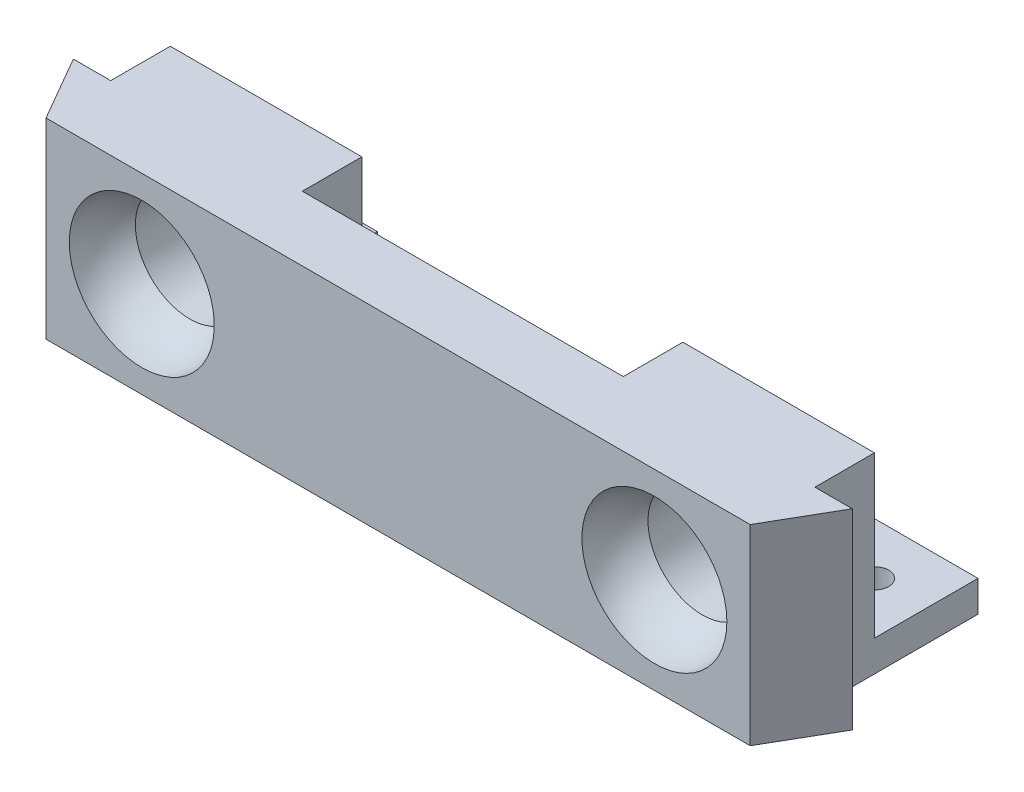
ISO-10303-21;
HEADER;
FILE_DESCRIPTION(('STEP AP214'),'2;1');
FILE_NAME('part.step','',(''),(''),'','','');
FILE_SCHEMA(('AUTOMOTIVE_DESIGN { 1 0 10303 214 1 1 1 1 }'));
ENDSEC;
DATA;
#1=APPLICATION_CONTEXT('core data for automotive mechanical design processes');
#2=APPLICATION_PROTOCOL_DEFINITION('international standard','automotive_design',2000,#1);
#3=PRODUCT_CONTEXT('',#1,'mechanical');
#4=PRODUCT('Part','Part','',(#3));
#5=PRODUCT_RELATED_PRODUCT_CATEGORY('part','',(#4));
#6=PRODUCT_DEFINITION_FORMATION('','',#4);
#7=PRODUCT_DEFINITION_CONTEXT('part definition',#1,'design');
#8=PRODUCT_DEFINITION('design','',#6,#7);
#9=PRODUCT_DEFINITION_SHAPE('','',#8);
#10=(LENGTH_UNIT() NAMED_UNIT(*) SI_UNIT(.MILLI.,.METRE.));
#11=(NAMED_UNIT(*) PLANE_ANGLE_UNIT() SI_UNIT($,.RADIAN.));
#12=(NAMED_UNIT(*) SI_UNIT($,.STERADIAN.) SOLID_ANGLE_UNIT());
#13=UNCERTAINTY_MEASURE_WITH_UNIT(LENGTH_MEASURE(1.E-05),#10,'distance_accuracy_value','');
#14=(GEOMETRIC_REPRESENTATION_CONTEXT(3) GLOBAL_UNCERTAINTY_ASSIGNED_CONTEXT((#13)) GLOBAL_UNIT_ASSIGNED_CONTEXT((#10,
#11,#12)) REPRESENTATION_CONTEXT('',''));
#15=CARTESIAN_POINT('',(0.,0.,0.));
#16=DIRECTION('',(0.,0.,1.));
#17=DIRECTION('',(1.,0.,0.));
#18=AXIS2_PLACEMENT_3D('',#15,#16,#17);
#19=CARTESIAN_POINT('',(34.,18.5,-12.));
#20=DIRECTION('',(0.,0.,1.));
#21=DIRECTION('',(1.,0.,0.));
#22=AXIS2_PLACEMENT_3D('',#19,#20,#21);
#23=PLANE('',#22);
#24=CARTESIAN_POINT('',(24.75,9.25,-12.));
#25=DIRECTION('',(0.,0.,1.));
#26=DIRECTION('',(1.,0.,0.));
#27=AXIS2_PLACEMENT_3D('',#24,#25,#26);
#28=CIRCLE('',#27,5.25);
#29=CARTESIAN_POINT('',(30.,9.25,-12.));
#30=VERTEX_POINT('',#29);
#31=EDGE_CURVE('E216',#30,#30,#28,.T.);
#32=ORIENTED_EDGE('',*,*,#31,.T.);
#33=EDGE_LOOP('',(#32));
#34=FACE_BOUND('',#33,.T.);
#35=DIRECTION('',(0.,-1.,0.));
#36=VECTOR('',#35,1.);
#37=CARTESIAN_POINT('',(24.,3.,-12.));
#38=LINE('',#37,#36);
#39=CARTESIAN_POINT('',(24.,3.,-12.));
#40=VERTEX_POINT('',#39);
#41=CARTESIAN_POINT('',(24.,0.,-12.));
#42=VERTEX_POINT('',#41);
#43=EDGE_CURVE('E181',#40,#42,#38,.T.);
#44=ORIENTED_EDGE('',*,*,#43,.T.);
#45=DIRECTION('',(-1.,0.,0.));
#46=VECTOR('',#45,1.);
#47=CARTESIAN_POINT('',(34.,0.,-12.));
#48=LINE('',#47,#46);
#49=CARTESIAN_POINT('',(15.5,0.,-12.));
#50=VERTEX_POINT('',#49);
#51=EDGE_CURVE('E269',#42,#50,#48,.T.);
#52=ORIENTED_EDGE('',*,*,#51,.T.);
#53=DIRECTION('',(0.,-1.,0.));
#54=VECTOR('',#53,1.);
#55=CARTESIAN_POINT('',(15.5,18.5,-12.));
#56=LINE('',#55,#54);
#57=CARTESIAN_POINT('',(15.5,18.5,-12.));
#58=VERTEX_POINT('',#57);
#59=EDGE_CURVE('E304',#58,#50,#56,.T.);
#60=ORIENTED_EDGE('',*,*,#59,.F.);
#61=DIRECTION('',(-1.,0.,0.));
#62=VECTOR('',#61,1.);
#63=CARTESIAN_POINT('',(34.,18.5,-12.));
#64=LINE('',#63,#62);
#65=CARTESIAN_POINT('',(34.,18.5,-12.));
#66=VERTEX_POINT('',#65);
#67=EDGE_CURVE('E245',#66,#58,#64,.T.);
#68=ORIENTED_EDGE('',*,*,#67,.F.);
#69=DIRECTION('',(0.,-1.,0.));
#70=VECTOR('',#69,1.);
#71=CARTESIAN_POINT('',(34.,18.5,-12.));
#72=LINE('',#71,#70);
#73=CARTESIAN_POINT('',(34.,3.,-12.));
#74=VERTEX_POINT('',#73);
#75=EDGE_CURVE('E53',#66,#74,#72,.T.);
#76=ORIENTED_EDGE('',*,*,#75,.T.);
#77=DIRECTION('',(1.,0.,0.));
#78=VECTOR('',#77,1.);
#79=CARTESIAN_POINT('',(34.,3.,-12.));
#80=LINE('',#79,#78);
#81=EDGE_CURVE('E48',#40,#74,#80,.T.);
#82=ORIENTED_EDGE('',*,*,#81,.F.);
#83=EDGE_LOOP('',(#44,#52,#60,#68,#76,#82));
#84=FACE_BOUND('',#83,.T.);
#85=ADVANCED_FACE('F33',(#34,#84),#23,.F.);
#86=CARTESIAN_POINT('',(-34.,18.5,-12.));
#87=DIRECTION('',(0.,0.,1.));
#88=DIRECTION('',(1.,0.,0.));
#89=AXIS2_PLACEMENT_3D('',#86,#87,#88);
#90=PLANE('',#89);
#91=CARTESIAN_POINT('',(-24.75,9.25,-12.));
#92=DIRECTION('',(0.,0.,-1.));
#93=DIRECTION('',(-1.,0.,0.));
#94=AXIS2_PLACEMENT_3D('',#91,#92,#93);
#95=CIRCLE('',#94,5.25);
#96=CARTESIAN_POINT('',(-30.,9.25,-12.));
#97=VERTEX_POINT('',#96);
#98=EDGE_CURVE('E225',#97,#97,#95,.T.);
#99=ORIENTED_EDGE('',*,*,#98,.F.);
#100=EDGE_LOOP('',(#99));
#101=FACE_BOUND('',#100,.T.);
#102=DIRECTION('',(0.,-1.,0.));
#103=VECTOR('',#102,1.);
#104=CARTESIAN_POINT('',(-24.,3.,-12.));
#105=LINE('',#104,#103);
#106=CARTESIAN_POINT('',(-24.,3.,-12.));
#107=VERTEX_POINT('',#106);
#108=CARTESIAN_POINT('',(-24.,0.,-12.));
#109=VERTEX_POINT('',#108);
#110=EDGE_CURVE('E213',#107,#109,#105,.T.);
#111=ORIENTED_EDGE('',*,*,#110,.F.);
#112=DIRECTION('',(1.,0.,0.));
#113=VECTOR('',#112,1.);
#114=CARTESIAN_POINT('',(-24.,3.,-12.));
#115=LINE('',#114,#113);
#116=CARTESIAN_POINT('',(-34.,3.,-12.));
#117=VERTEX_POINT('',#116);
#118=EDGE_CURVE('E193',#117,#107,#115,.T.);
#119=ORIENTED_EDGE('',*,*,#118,.F.);
#120=DIRECTION('',(0.,-1.,0.));
#121=VECTOR('',#120,1.);
#122=CARTESIAN_POINT('',(-34.,18.5,-12.));
#123=LINE('',#122,#121);
#124=CARTESIAN_POINT('',(-34.,18.5,-12.));
#125=VERTEX_POINT('',#124);
#126=EDGE_CURVE('E292',#125,#117,#123,.T.);
#127=ORIENTED_EDGE('',*,*,#126,.F.);
#128=DIRECTION('',(-1.,0.,0.));
#129=VECTOR('',#128,1.);
#130=CARTESIAN_POINT('',(-34.,18.5,-12.));
#131=LINE('',#130,#129);
#132=CARTESIAN_POINT('',(-15.5,18.5,-12.));
#133=VERTEX_POINT('',#132);
#134=EDGE_CURVE('E253',#133,#125,#131,.T.);
#135=ORIENTED_EDGE('',*,*,#134,.F.);
#136=DIRECTION('',(0.,-1.,0.));
#137=VECTOR('',#136,1.);
#138=CARTESIAN_POINT('',(-15.5,18.5,-12.));
#139=LINE('',#138,#137);
#140=CARTESIAN_POINT('',(-15.5,0.,-12.));
#141=VERTEX_POINT('',#140);
#142=EDGE_CURVE('E295',#133,#141,#139,.T.);
#143=ORIENTED_EDGE('',*,*,#142,.T.);
#144=DIRECTION('',(-1.,0.,0.));
#145=VECTOR('',#144,1.);
#146=CARTESIAN_POINT('',(-34.,0.,-12.));
#147=LINE('',#146,#145);
#148=EDGE_CURVE('E277',#141,#109,#147,.T.);
#149=ORIENTED_EDGE('',*,*,#148,.T.);
#150=EDGE_LOOP('',(#111,#119,#127,#135,#143,#149));
#151=FACE_BOUND('',#150,.T.);
#152=ADVANCED_FACE('F376',(#101,#151),#90,.F.);
#153=CARTESIAN_POINT('',(34.,18.5,0.));
#154=DIRECTION('',(0.,0.,-1.));
#155=DIRECTION('',(-1.,0.,0.));
#156=AXIS2_PLACEMENT_3D('',#153,#154,#155);
#157=PLANE('',#156);
#158=CARTESIAN_POINT('',(24.75,9.25,0.));
#159=DIRECTION('',(0.,0.,1.));
#160=DIRECTION('',(1.,0.,0.));
#161=AXIS2_PLACEMENT_3D('',#158,#159,#160);
#162=CIRCLE('',#161,7.);
#163=CARTESIAN_POINT('',(31.75,9.25,0.));
#164=VERTEX_POINT('',#163);
#165=EDGE_CURVE('E222',#164,#164,#162,.T.);
#166=ORIENTED_EDGE('',*,*,#165,.F.);
#167=EDGE_LOOP('',(#166));
#168=FACE_BOUND('',#167,.T.);
#169=CARTESIAN_POINT('',(-24.75,9.25,0.));
#170=DIRECTION('',(0.,0.,-1.));
#171=DIRECTION('',(-1.,0.,0.));
#172=AXIS2_PLACEMENT_3D('',#169,#170,#171);
#173=CIRCLE('',#172,7.);
#174=CARTESIAN_POINT('',(-31.75,9.25,0.));
#175=VERTEX_POINT('',#174);
#176=EDGE_CURVE('E231',#175,#175,#173,.T.);
#177=ORIENTED_EDGE('',*,*,#176,.T.);
#178=EDGE_LOOP('',(#177));
#179=FACE_BOUND('',#178,.T.);
#180=DIRECTION('',(1.,0.,0.));
#181=VECTOR('',#180,1.);
#182=CARTESIAN_POINT('',(34.,0.,0.));
#183=LINE('',#182,#181);
#184=CARTESIAN_POINT('',(-34.,0.,0.));
#185=VERTEX_POINT('',#184);
#186=CARTESIAN_POINT('',(34.,0.,0.));
#187=VERTEX_POINT('',#186);
#188=EDGE_CURVE('E234',#185,#187,#183,.T.);
#189=ORIENTED_EDGE('',*,*,#188,.T.);
#190=DIRECTION('',(0.,-1.,0.));
#191=VECTOR('',#190,1.);
#192=CARTESIAN_POINT('',(34.,18.5,0.));
#193=LINE('',#192,#191);
#194=CARTESIAN_POINT('',(34.,18.5,0.));
#195=VERTEX_POINT('',#194);
#196=EDGE_CURVE('E11',#195,#187,#193,.T.);
#197=ORIENTED_EDGE('',*,*,#196,.F.);
#198=DIRECTION('',(1.,0.,0.));
#199=VECTOR('',#198,1.);
#200=CARTESIAN_POINT('',(34.,18.5,0.));
#201=LINE('',#200,#199);
#202=CARTESIAN_POINT('',(-34.,18.5,0.));
#203=VERTEX_POINT('',#202);
#204=EDGE_CURVE('E235',#203,#195,#201,.T.);
#205=ORIENTED_EDGE('',*,*,#204,.F.);
#206=DIRECTION('',(0.,-1.,0.));
#207=VECTOR('',#206,1.);
#208=CARTESIAN_POINT('',(-34.,18.5,0.));
#209=LINE('',#208,#207);
#210=EDGE_CURVE('E261',#203,#185,#209,.T.);
#211=ORIENTED_EDGE('',*,*,#210,.T.);
#212=EDGE_LOOP('',(#189,#197,#205,#211));
#213=FACE_BOUND('',#212,.T.);
#214=ADVANCED_FACE('F35',(#168,#179,#213),#157,.F.);
#215=CARTESIAN_POINT('',(37.6084391824352,18.5,-6.24999999999999));
#216=DIRECTION('',(-0.866025403784436,0.,-0.500000000000004));
#217=DIRECTION('',(-0.500000000000005,0.,0.866025403784436));
#218=AXIS2_PLACEMENT_3D('',#215,#216,#217);
#219=PLANE('',#218);
#220=DIRECTION('',(0.500000000000004,0.,-0.866025403784436));
#221=VECTOR('',#220,1.);
#222=CARTESIAN_POINT('',(37.6084391824352,0.,-6.24999999999999));
#223=LINE('',#222,#221);
#224=CARTESIAN_POINT('',(37.6084391824352,0.,-6.24999999999999));
#225=VERTEX_POINT('',#224);
#226=EDGE_CURVE('E264',#187,#225,#223,.T.);
#227=ORIENTED_EDGE('',*,*,#226,.T.);
#228=DIRECTION('',(0.,-1.,0.));
#229=VECTOR('',#228,1.);
#230=CARTESIAN_POINT('',(37.6084391824352,18.5,-6.24999999999999));
#231=LINE('',#230,#229);
#232=CARTESIAN_POINT('',(37.6084391824352,18.5,-6.24999999999999));
#233=VERTEX_POINT('',#232);
#234=EDGE_CURVE('E41',#233,#225,#231,.T.);
#235=ORIENTED_EDGE('',*,*,#234,.F.);
#236=DIRECTION('',(0.500000000000004,0.,-0.866025403784436));
#237=VECTOR('',#236,1.);
#238=CARTESIAN_POINT('',(37.6084391824352,18.5,-6.24999999999999));
#239=LINE('',#238,#237);
#240=EDGE_CURVE('E238',#195,#233,#239,.T.);
#241=ORIENTED_EDGE('',*,*,#240,.F.);
#242=ORIENTED_EDGE('',*,*,#196,.T.);
#243=EDGE_LOOP('',(#227,#235,#241,#242));
#244=FACE_BOUND('',#243,.T.);
#245=ADVANCED_FACE('F348',(#244),#219,.F.);
#246=CARTESIAN_POINT('',(34.,18.5,-6.24999999999999));
#247=DIRECTION('',(0.,0.,1.));
#248=DIRECTION('',(1.,0.,0.));
#249=AXIS2_PLACEMENT_3D('',#246,#247,#248);
#250=PLANE('',#249);
#251=DIRECTION('',(-1.,0.,0.));
#252=VECTOR('',#251,1.);
#253=CARTESIAN_POINT('',(34.,0.,-6.24999999999999));
#254=LINE('',#253,#252);
#255=CARTESIAN_POINT('',(34.,0.,-6.24999999999999));
#256=VERTEX_POINT('',#255);
#257=EDGE_CURVE('E266',#225,#256,#254,.T.);
#258=ORIENTED_EDGE('',*,*,#257,.T.);
#259=DIRECTION('',(0.,-1.,0.));
#260=VECTOR('',#259,1.);
#261=CARTESIAN_POINT('',(34.,18.5,-6.24999999999999));
#262=LINE('',#261,#260);
#263=CARTESIAN_POINT('',(34.,18.5,-6.24999999999999));
#264=VERTEX_POINT('',#263);
#265=EDGE_CURVE('E308',#264,#256,#262,.T.);
#266=ORIENTED_EDGE('',*,*,#265,.F.);
#267=DIRECTION('',(-1.,0.,0.));
#268=VECTOR('',#267,1.);
#269=CARTESIAN_POINT('',(34.,18.5,-6.24999999999999));
#270=LINE('',#269,#268);
#271=EDGE_CURVE('E241',#233,#264,#270,.T.);
#272=ORIENTED_EDGE('',*,*,#271,.F.);
#273=ORIENTED_EDGE('',*,*,#234,.T.);
#274=EDGE_LOOP('',(#258,#266,#272,#273));
#275=FACE_BOUND('',#274,.T.);
#276=ADVANCED_FACE('F314',(#275),#250,.F.);
#277=CARTESIAN_POINT('',(34.,18.5,-6.24999999999999));
#278=DIRECTION('',(-1.,0.,0.));
#279=DIRECTION('',(0.,0.,1.));
#280=AXIS2_PLACEMENT_3D('',#277,#278,#279);
#281=PLANE('',#280);
#282=DIRECTION('',(0.,0.,-1.));
#283=VECTOR('',#282,1.);
#284=CARTESIAN_POINT('',(34.,0.,-6.24999999999999));
#285=LINE('',#284,#283);
#286=CARTESIAN_POINT('',(34.,0.,-22.));
#287=VERTEX_POINT('',#286);
#288=EDGE_CURVE('E170',#256,#287,#285,.T.);
#289=ORIENTED_EDGE('',*,*,#288,.T.);
#290=DIRECTION('',(0.,-1.,0.));
#291=VECTOR('',#290,1.);
#292=CARTESIAN_POINT('',(34.,3.,-22.));
#293=LINE('',#292,#291);
#294=CARTESIAN_POINT('',(34.,3.,-22.));
#295=VERTEX_POINT('',#294);
#296=EDGE_CURVE('E166',#295,#287,#293,.T.);
#297=ORIENTED_EDGE('',*,*,#296,.F.);
#298=DIRECTION('',(0.,0.,-1.));
#299=VECTOR('',#298,1.);
#300=CARTESIAN_POINT('',(34.,3.,-22.));
#301=LINE('',#300,#299);
#302=EDGE_CURVE('E157',#74,#295,#301,.T.);
#303=ORIENTED_EDGE('',*,*,#302,.F.);
#304=ORIENTED_EDGE('',*,*,#75,.F.);
#305=DIRECTION('',(0.,0.,-1.));
#306=VECTOR('',#305,1.);
#307=CARTESIAN_POINT('',(34.,18.5,-6.24999999999999));
#308=LINE('',#307,#306);
#309=EDGE_CURVE('E243',#264,#66,#308,.T.);
#310=ORIENTED_EDGE('',*,*,#309,.F.);
#311=ORIENTED_EDGE('',*,*,#265,.T.);
#312=EDGE_LOOP('',(#289,#297,#303,#304,#310,#311));
#313=FACE_BOUND('',#312,.T.);
#314=ADVANCED_FACE('F167',(#313),#281,.F.);
#315=CARTESIAN_POINT('',(15.5,18.5,-12.));
#316=DIRECTION('',(1.,0.,0.));
#317=DIRECTION('',(0.,0.,-1.));
#318=AXIS2_PLACEMENT_3D('',#315,#316,#317);
#319=PLANE('',#318);
#320=DIRECTION('',(0.,0.,1.));
#321=VECTOR('',#320,1.);
#322=CARTESIAN_POINT('',(15.5,0.,-12.));
#323=LINE('',#322,#321);
#324=CARTESIAN_POINT('',(15.5,0.,-6.24999999999999));
#325=VERTEX_POINT('',#324);
#326=EDGE_CURVE('E271',#50,#325,#323,.T.);
#327=ORIENTED_EDGE('',*,*,#326,.T.);
#328=DIRECTION('',(0.,-1.,0.));
#329=VECTOR('',#328,1.);
#330=CARTESIAN_POINT('',(15.5,18.5,-6.24999999999999));
#331=LINE('',#330,#329);
#332=CARTESIAN_POINT('',(15.5,18.5,-6.24999999999999));
#333=VERTEX_POINT('',#332);
#334=EDGE_CURVE('E301',#333,#325,#331,.T.);
#335=ORIENTED_EDGE('',*,*,#334,.F.);
#336=DIRECTION('',(0.,0.,1.));
#337=VECTOR('',#336,1.);
#338=CARTESIAN_POINT('',(15.5,18.5,-12.));
#339=LINE('',#338,#337);
#340=EDGE_CURVE('E247',#58,#333,#339,.T.);
#341=ORIENTED_EDGE('',*,*,#340,.F.);
#342=ORIENTED_EDGE('',*,*,#59,.T.);
#343=EDGE_LOOP('',(#327,#335,#341,#342));
#344=FACE_BOUND('',#343,.T.);
#345=ADVANCED_FACE('F328',(#344),#319,.F.);
#346=CARTESIAN_POINT('',(-15.5,18.5,-6.24999999999999));
#347=DIRECTION('',(0.,0.,1.));
#348=DIRECTION('',(1.,0.,0.));
#349=AXIS2_PLACEMENT_3D('',#346,#347,#348);
#350=PLANE('',#349);
#351=DIRECTION('',(-1.,0.,0.));
#352=VECTOR('',#351,1.);
#353=CARTESIAN_POINT('',(-15.5,0.,-6.24999999999999));
#354=LINE('',#353,#352);
#355=CARTESIAN_POINT('',(-15.5,0.,-6.24999999999999));
#356=VERTEX_POINT('',#355);
#357=EDGE_CURVE('E273',#325,#356,#354,.T.);
#358=ORIENTED_EDGE('',*,*,#357,.T.);
#359=DIRECTION('',(0.,-1.,0.));
#360=VECTOR('',#359,1.);
#361=CARTESIAN_POINT('',(-15.5,18.5,-6.24999999999999));
#362=LINE('',#361,#360);
#363=CARTESIAN_POINT('',(-15.5,18.5,-6.24999999999999));
#364=VERTEX_POINT('',#363);
#365=EDGE_CURVE('E298',#364,#356,#362,.T.);
#366=ORIENTED_EDGE('',*,*,#365,.F.);
#367=DIRECTION('',(-1.,0.,0.));
#368=VECTOR('',#367,1.);
#369=CARTESIAN_POINT('',(-15.5,18.5,-6.24999999999999));
#370=LINE('',#369,#368);
#371=EDGE_CURVE('E249',#333,#364,#370,.T.);
#372=ORIENTED_EDGE('',*,*,#371,.F.);
#373=ORIENTED_EDGE('',*,*,#334,.T.);
#374=EDGE_LOOP('',(#358,#366,#372,#373));
#375=FACE_BOUND('',#374,.T.);
#376=ADVANCED_FACE('F335',(#375),#350,.F.);
#377=CARTESIAN_POINT('',(-15.5,18.5,-12.));
#378=DIRECTION('',(-1.,0.,0.));
#379=DIRECTION('',(0.,0.,1.));
#380=AXIS2_PLACEMENT_3D('',#377,#378,#379);
#381=PLANE('',#380);
#382=DIRECTION('',(0.,0.,-1.));
#383=VECTOR('',#382,1.);
#384=CARTESIAN_POINT('',(-15.5,0.,-12.));
#385=LINE('',#384,#383);
#386=EDGE_CURVE('E275',#356,#141,#385,.T.);
#387=ORIENTED_EDGE('',*,*,#386,.T.);
#388=ORIENTED_EDGE('',*,*,#142,.F.);
#389=DIRECTION('',(0.,0.,-1.));
#390=VECTOR('',#389,1.);
#391=CARTESIAN_POINT('',(-15.5,18.5,-12.));
#392=LINE('',#391,#390);
#393=EDGE_CURVE('E251',#364,#133,#392,.T.);
#394=ORIENTED_EDGE('',*,*,#393,.F.);
#395=ORIENTED_EDGE('',*,*,#365,.T.);
#396=EDGE_LOOP('',(#387,#388,#394,#395));
#397=FACE_BOUND('',#396,.T.);
#398=ADVANCED_FACE('F339',(#397),#381,.F.);
#399=CARTESIAN_POINT('',(-34.,18.5,-6.24999999999999));
#400=DIRECTION('',(1.,0.,0.));
#401=DIRECTION('',(0.,0.,-1.));
#402=AXIS2_PLACEMENT_3D('',#399,#400,#401);
#403=PLANE('',#402);
#404=DIRECTION('',(0.,0.,1.));
#405=VECTOR('',#404,1.);
#406=CARTESIAN_POINT('',(-34.,0.,-6.24999999999999));
#407=LINE('',#406,#405);
#408=CARTESIAN_POINT('',(-34.,0.,-22.));
#409=VERTEX_POINT('',#408);
#410=CARTESIAN_POINT('',(-34.,0.,-6.24999999999999));
#411=VERTEX_POINT('',#410);
#412=EDGE_CURVE('E279',#409,#411,#407,.T.);
#413=ORIENTED_EDGE('',*,*,#412,.T.);
#414=DIRECTION('',(0.,-1.,0.));
#415=VECTOR('',#414,1.);
#416=CARTESIAN_POINT('',(-34.,18.5,-6.24999999999999));
#417=LINE('',#416,#415);
#418=CARTESIAN_POINT('',(-34.,18.5,-6.24999999999999));
#419=VERTEX_POINT('',#418);
#420=EDGE_CURVE('E289',#419,#411,#417,.T.);
#421=ORIENTED_EDGE('',*,*,#420,.F.);
#422=DIRECTION('',(0.,0.,1.));
#423=VECTOR('',#422,1.);
#424=CARTESIAN_POINT('',(-34.,18.5,-6.24999999999999));
#425=LINE('',#424,#423);
#426=EDGE_CURVE('E255',#125,#419,#425,.T.);
#427=ORIENTED_EDGE('',*,*,#426,.F.);
#428=ORIENTED_EDGE('',*,*,#126,.T.);
#429=DIRECTION('',(0.,0.,1.));
#430=VECTOR('',#429,1.);
#431=CARTESIAN_POINT('',(-34.,3.,-12.));
#432=LINE('',#431,#430);
#433=CARTESIAN_POINT('',(-34.,3.,-22.));
#434=VERTEX_POINT('',#433);
#435=EDGE_CURVE('E201',#434,#117,#432,.T.);
#436=ORIENTED_EDGE('',*,*,#435,.F.);
#437=DIRECTION('',(0.,-1.,0.));
#438=VECTOR('',#437,1.);
#439=CARTESIAN_POINT('',(-34.,3.,-22.));
#440=LINE('',#439,#438);
#441=EDGE_CURVE('E204',#434,#409,#440,.T.);
#442=ORIENTED_EDGE('',*,*,#441,.T.);
#443=EDGE_LOOP('',(#413,#421,#427,#428,#436,#442));
#444=FACE_BOUND('',#443,.T.);
#445=ADVANCED_FACE('F363',(#444),#403,.F.);
#446=CARTESIAN_POINT('',(-37.6084391824352,18.5,-6.24999999999999));
#447=DIRECTION('',(0.,0.,1.));
#448=DIRECTION('',(1.,0.,0.));
#449=AXIS2_PLACEMENT_3D('',#446,#447,#448);
#450=PLANE('',#449);
#451=DIRECTION('',(-1.,0.,0.));
#452=VECTOR('',#451,1.);
#453=CARTESIAN_POINT('',(-37.6084391824352,0.,-6.24999999999999));
#454=LINE('',#453,#452);
#455=CARTESIAN_POINT('',(-37.6084391824352,0.,-6.24999999999999));
#456=VERTEX_POINT('',#455);
#457=EDGE_CURVE('E281',#411,#456,#454,.T.);
#458=ORIENTED_EDGE('',*,*,#457,.T.);
#459=DIRECTION('',(0.,-1.,0.));
#460=VECTOR('',#459,1.);
#461=CARTESIAN_POINT('',(-37.6084391824352,18.5,-6.24999999999999));
#462=LINE('',#461,#460);
#463=CARTESIAN_POINT('',(-37.6084391824352,18.5,-6.24999999999999));
#464=VERTEX_POINT('',#463);
#465=EDGE_CURVE('E286',#464,#456,#462,.T.);
#466=ORIENTED_EDGE('',*,*,#465,.F.);
#467=DIRECTION('',(-1.,0.,0.));
#468=VECTOR('',#467,1.);
#469=CARTESIAN_POINT('',(-37.6084391824352,18.5,-6.24999999999999));
#470=LINE('',#469,#468);
#471=EDGE_CURVE('E257',#419,#464,#470,.T.);
#472=ORIENTED_EDGE('',*,*,#471,.F.);
#473=ORIENTED_EDGE('',*,*,#420,.T.);
#474=EDGE_LOOP('',(#458,#466,#472,#473));
#475=FACE_BOUND('',#474,.T.);
#476=ADVANCED_FACE('F359',(#475),#450,.F.);
#477=CARTESIAN_POINT('',(-34.,18.5,0.));
#478=DIRECTION('',(0.866025403784436,0.,-0.500000000000005));
#479=DIRECTION('',(-0.500000000000005,0.,-0.866025403784436));
#480=AXIS2_PLACEMENT_3D('',#477,#478,#479);
#481=PLANE('',#480);
#482=DIRECTION('',(0.500000000000005,0.,0.866025403784436));
#483=VECTOR('',#482,1.);
#484=CARTESIAN_POINT('',(-34.,0.,0.));
#485=LINE('',#484,#483);
#486=EDGE_CURVE('E239',#456,#185,#485,.T.);
#487=ORIENTED_EDGE('',*,*,#486,.T.);
#488=ORIENTED_EDGE('',*,*,#210,.F.);
#489=DIRECTION('',(0.500000000000005,0.,0.866025403784436));
#490=VECTOR('',#489,1.);
#491=CARTESIAN_POINT('',(-34.,18.5,0.));
#492=LINE('',#491,#490);
#493=EDGE_CURVE('E259',#464,#203,#492,.T.);
#494=ORIENTED_EDGE('',*,*,#493,.F.);
#495=ORIENTED_EDGE('',*,*,#465,.T.);
#496=EDGE_LOOP('',(#487,#488,#494,#495));
#497=FACE_BOUND('',#496,.T.);
#498=ADVANCED_FACE('F354',(#497),#481,.F.);
#499=CARTESIAN_POINT('',(0.,18.5,0.));
#500=DIRECTION('',(0.,-1.,0.));
#501=DIRECTION('',(0.,0.,-1.));
#502=AXIS2_PLACEMENT_3D('',#499,#500,#501);
#503=PLANE('',#502);
#504=ORIENTED_EDGE('',*,*,#204,.T.);
#505=ORIENTED_EDGE('',*,*,#240,.T.);
#506=ORIENTED_EDGE('',*,*,#271,.T.);
#507=ORIENTED_EDGE('',*,*,#309,.T.);
#508=ORIENTED_EDGE('',*,*,#67,.T.);
#509=ORIENTED_EDGE('',*,*,#340,.T.);
#510=ORIENTED_EDGE('',*,*,#371,.T.);
#511=ORIENTED_EDGE('',*,*,#393,.T.);
#512=ORIENTED_EDGE('',*,*,#134,.T.);
#513=ORIENTED_EDGE('',*,*,#426,.T.);
#514=ORIENTED_EDGE('',*,*,#471,.T.);
#515=ORIENTED_EDGE('',*,*,#493,.T.);
#516=EDGE_LOOP('',(#504,#505,#506,#507,#508,#509,#510,#511,#512,#513,#514,#515));
#517=FACE_BOUND('',#516,.T.);
#518=ADVANCED_FACE('F343',(#517),#503,.F.);
#519=CARTESIAN_POINT('',(0.,0.,0.));
#520=DIRECTION('',(0.,-1.,0.));
#521=DIRECTION('',(0.,0.,-1.));
#522=AXIS2_PLACEMENT_3D('',#519,#520,#521);
#523=PLANE('',#522);
#524=CARTESIAN_POINT('',(29.,0.,-17.));
#525=DIRECTION('',(0.,-1.,0.));
#526=DIRECTION('',(0.,0.,1.));
#527=AXIS2_PLACEMENT_3D('',#524,#525,#526);
#528=CIRCLE('',#527,1.375);
#529=CARTESIAN_POINT('',(29.,0.,-15.625));
#530=VERTEX_POINT('',#529);
#531=EDGE_CURVE('E570',#530,#530,#528,.T.);
#532=ORIENTED_EDGE('',*,*,#531,.F.);
#533=EDGE_LOOP('',(#532));
#534=FACE_BOUND('',#533,.T.);
#535=CARTESIAN_POINT('',(-29.,0.,-17.));
#536=DIRECTION('',(0.,1.,0.));
#537=DIRECTION('',(0.,0.,1.));
#538=AXIS2_PLACEMENT_3D('',#535,#536,#537);
#539=CIRCLE('',#538,1.375);
#540=CARTESIAN_POINT('',(-29.,0.,-15.625));
#541=VERTEX_POINT('',#540);
#542=EDGE_CURVE('E188',#541,#541,#539,.T.);
#543=ORIENTED_EDGE('',*,*,#542,.T.);
#544=EDGE_LOOP('',(#543));
#545=FACE_BOUND('',#544,.T.);
#546=ORIENTED_EDGE('',*,*,#188,.F.);
#547=ORIENTED_EDGE('',*,*,#486,.F.);
#548=ORIENTED_EDGE('',*,*,#457,.F.);
#549=ORIENTED_EDGE('',*,*,#412,.F.);
#550=DIRECTION('',(-1.,0.,0.));
#551=VECTOR('',#550,1.);
#552=CARTESIAN_POINT('',(-34.,0.,-22.));
#553=LINE('',#552,#551);
#554=CARTESIAN_POINT('',(-24.,0.,-22.));
#555=VERTEX_POINT('',#554);
#556=EDGE_CURVE('E197',#555,#409,#553,.T.);
#557=ORIENTED_EDGE('',*,*,#556,.F.);
#558=DIRECTION('',(0.,0.,-1.));
#559=VECTOR('',#558,1.);
#560=CARTESIAN_POINT('',(-24.,0.,-22.));
#561=LINE('',#560,#559);
#562=EDGE_CURVE('E173',#109,#555,#561,.T.);
#563=ORIENTED_EDGE('',*,*,#562,.F.);
#564=ORIENTED_EDGE('',*,*,#148,.F.);
#565=ORIENTED_EDGE('',*,*,#386,.F.);
#566=ORIENTED_EDGE('',*,*,#357,.F.);
#567=ORIENTED_EDGE('',*,*,#326,.F.);
#568=ORIENTED_EDGE('',*,*,#51,.F.);
#569=DIRECTION('',(0.,0.,1.));
#570=VECTOR('',#569,1.);
#571=CARTESIAN_POINT('',(24.,0.,-12.));
#572=LINE('',#571,#570);
#573=CARTESIAN_POINT('',(24.,0.,-22.));
#574=VERTEX_POINT('',#573);
#575=EDGE_CURVE('E187',#574,#42,#572,.T.);
#576=ORIENTED_EDGE('',*,*,#575,.F.);
#577=DIRECTION('',(-1.,0.,0.));
#578=VECTOR('',#577,1.);
#579=CARTESIAN_POINT('',(24.,0.,-22.));
#580=LINE('',#579,#578);
#581=EDGE_CURVE('E185',#287,#574,#580,.T.);
#582=ORIENTED_EDGE('',*,*,#581,.F.);
#583=ORIENTED_EDGE('',*,*,#288,.F.);
#584=ORIENTED_EDGE('',*,*,#257,.F.);
#585=ORIENTED_EDGE('',*,*,#226,.F.);
#586=EDGE_LOOP('',(#546,#547,#548,#549,#557,#563,#564,#565,#566,#567,#568,#576,#582,#583,#584,#585));
#587=FACE_BOUND('',#586,.T.);
#588=ADVANCED_FACE('F319',(#534,#545,#587),#523,.T.);
#589=CARTESIAN_POINT('',(-24.75,9.25,0.));
#590=DIRECTION('',(0.,0.,-1.));
#591=DIRECTION('',(-1.,0.,0.));
#592=AXIS2_PLACEMENT_3D('',#589,#590,#591);
#593=SPHERICAL_SURFACE('',#592,7.);
#594=ORIENTED_EDGE('',*,*,#176,.F.);
#595=EDGE_LOOP('',(#594));
#596=FACE_BOUND('',#595,.T.);
#597=CARTESIAN_POINT('',(-24.75,9.25,-4.63006479436301));
#598=DIRECTION('',(0.,0.,-1.));
#599=DIRECTION('',(-1.,0.,0.));
#600=AXIS2_PLACEMENT_3D('',#597,#598,#599);
#601=CIRCLE('',#600,5.25000000000001);
#602=CARTESIAN_POINT('',(-30.,9.25,-4.63006479436301));
#603=VERTEX_POINT('',#602);
#604=EDGE_CURVE('E228',#603,#603,#601,.T.);
#605=ORIENTED_EDGE('',*,*,#604,.T.);
#606=EDGE_LOOP('',(#605));
#607=FACE_BOUND('',#606,.T.);
#608=ADVANCED_FACE('F415',(#596,#607),#593,.F.);
#609=CARTESIAN_POINT('',(-24.75,9.25,-35.7158207754107));
#610=DIRECTION('',(0.,0.,-1.));
#611=DIRECTION('',(-1.,0.,0.));
#612=AXIS2_PLACEMENT_3D('',#609,#610,#611);
#613=CYLINDRICAL_SURFACE('',#612,5.25000000000001);
#614=ORIENTED_EDGE('',*,*,#604,.F.);
#615=EDGE_LOOP('',(#614));
#616=FACE_BOUND('',#615,.T.);
#617=ORIENTED_EDGE('',*,*,#98,.T.);
#618=EDGE_LOOP('',(#617));
#619=FACE_BOUND('',#618,.T.);
#620=ADVANCED_FACE('F418',(#616,#619),#613,.F.);
#621=CARTESIAN_POINT('',(24.75,9.25,0.));
#622=DIRECTION('',(0.,0.,-1.));
#623=DIRECTION('',(1.,0.,0.));
#624=AXIS2_PLACEMENT_3D('',#621,#622,#623);
#625=SPHERICAL_SURFACE('',#624,7.);
#626=ORIENTED_EDGE('',*,*,#165,.T.);
#627=EDGE_LOOP('',(#626));
#628=FACE_BOUND('',#627,.T.);
#629=CARTESIAN_POINT('',(24.75,9.25,-4.63006479436301));
#630=DIRECTION('',(0.,0.,1.));
#631=DIRECTION('',(1.,0.,0.));
#632=AXIS2_PLACEMENT_3D('',#629,#630,#631);
#633=CIRCLE('',#632,5.25000000000001);
#634=CARTESIAN_POINT('',(30.,9.25,-4.63006479436301));
#635=VERTEX_POINT('',#634);
#636=EDGE_CURVE('E219',#635,#635,#633,.T.);
#637=ORIENTED_EDGE('',*,*,#636,.F.);
#638=EDGE_LOOP('',(#637));
#639=FACE_BOUND('',#638,.T.);
#640=ADVANCED_FACE('F424',(#628,#639),#625,.F.);
#641=CARTESIAN_POINT('',(24.75,9.25,-35.7158207754107));
#642=DIRECTION('',(0.,0.,-1.));
#643=DIRECTION('',(1.,0.,0.));
#644=AXIS2_PLACEMENT_3D('',#641,#642,#643);
#645=CYLINDRICAL_SURFACE('',#644,5.25000000000001);
#646=ORIENTED_EDGE('',*,*,#636,.T.);
#647=EDGE_LOOP('',(#646));
#648=FACE_BOUND('',#647,.T.);
#649=ORIENTED_EDGE('',*,*,#31,.F.);
#650=EDGE_LOOP('',(#649));
#651=FACE_BOUND('',#650,.T.);
#652=ADVANCED_FACE('F430',(#648,#651),#645,.F.);
#653=CARTESIAN_POINT('',(-24.,3.,-22.));
#654=DIRECTION('',(-1.,0.,0.));
#655=DIRECTION('',(0.,0.,1.));
#656=AXIS2_PLACEMENT_3D('',#653,#654,#655);
#657=PLANE('',#656);
#658=ORIENTED_EDGE('',*,*,#562,.T.);
#659=DIRECTION('',(0.,-1.,0.));
#660=VECTOR('',#659,1.);
#661=CARTESIAN_POINT('',(-24.,3.,-22.));
#662=LINE('',#661,#660);
#663=CARTESIAN_POINT('',(-24.,3.,-22.));
#664=VERTEX_POINT('',#663);
#665=EDGE_CURVE('E210',#664,#555,#662,.T.);
#666=ORIENTED_EDGE('',*,*,#665,.F.);
#667=DIRECTION('',(0.,0.,-1.));
#668=VECTOR('',#667,1.);
#669=CARTESIAN_POINT('',(-24.,3.,-22.));
#670=LINE('',#669,#668);
#671=EDGE_CURVE('E196',#107,#664,#670,.T.);
#672=ORIENTED_EDGE('',*,*,#671,.F.);
#673=ORIENTED_EDGE('',*,*,#110,.T.);
#674=EDGE_LOOP('',(#658,#666,#672,#673));
#675=FACE_BOUND('',#674,.T.);
#676=ADVANCED_FACE('F374',(#675),#657,.F.);
#677=CARTESIAN_POINT('',(-34.,3.,-22.));
#678=DIRECTION('',(0.,0.,1.));
#679=DIRECTION('',(1.,0.,0.));
#680=AXIS2_PLACEMENT_3D('',#677,#678,#679);
#681=PLANE('',#680);
#682=ORIENTED_EDGE('',*,*,#556,.T.);
#683=ORIENTED_EDGE('',*,*,#441,.F.);
#684=DIRECTION('',(-1.,0.,0.));
#685=VECTOR('',#684,1.);
#686=CARTESIAN_POINT('',(-34.,3.,-22.));
#687=LINE('',#686,#685);
#688=EDGE_CURVE('E199',#664,#434,#687,.T.);
#689=ORIENTED_EDGE('',*,*,#688,.F.);
#690=ORIENTED_EDGE('',*,*,#665,.T.);
#691=EDGE_LOOP('',(#682,#683,#689,#690));
#692=FACE_BOUND('',#691,.T.);
#693=ADVANCED_FACE('F369',(#692),#681,.F.);
#694=CARTESIAN_POINT('',(0.,3.,0.));
#695=DIRECTION('',(0.,-1.,0.));
#696=DIRECTION('',(0.,0.,-1.));
#697=AXIS2_PLACEMENT_3D('',#694,#695,#696);
#698=PLANE('',#697);
#699=CARTESIAN_POINT('',(-29.,3.,-17.));
#700=DIRECTION('',(0.,1.,0.));
#701=DIRECTION('',(0.,0.,1.));
#702=AXIS2_PLACEMENT_3D('',#699,#700,#701);
#703=CIRCLE('',#702,1.375);
#704=CARTESIAN_POINT('',(-29.,3.,-15.625));
#705=VERTEX_POINT('',#704);
#706=EDGE_CURVE('E573',#705,#705,#703,.T.);
#707=ORIENTED_EDGE('',*,*,#706,.F.);
#708=EDGE_LOOP('',(#707));
#709=FACE_BOUND('',#708,.T.);
#710=ORIENTED_EDGE('',*,*,#118,.T.);
#711=ORIENTED_EDGE('',*,*,#671,.T.);
#712=ORIENTED_EDGE('',*,*,#688,.T.);
#713=ORIENTED_EDGE('',*,*,#435,.T.);
#714=EDGE_LOOP('',(#710,#711,#712,#713));
#715=FACE_BOUND('',#714,.T.);
#716=ADVANCED_FACE('F378',(#709,#715),#698,.F.);
#717=CARTESIAN_POINT('',(24.,3.,-22.));
#718=DIRECTION('',(0.,0.,1.));
#719=DIRECTION('',(1.,0.,0.));
#720=AXIS2_PLACEMENT_3D('',#717,#718,#719);
#721=PLANE('',#720);
#722=ORIENTED_EDGE('',*,*,#581,.T.);
#723=DIRECTION('',(0.,-1.,0.));
#724=VECTOR('',#723,1.);
#725=CARTESIAN_POINT('',(24.,3.,-22.));
#726=LINE('',#725,#724);
#727=CARTESIAN_POINT('',(24.,3.,-22.));
#728=VERTEX_POINT('',#727);
#729=EDGE_CURVE('E174',#728,#574,#726,.T.);
#730=ORIENTED_EDGE('',*,*,#729,.F.);
#731=DIRECTION('',(-1.,0.,0.));
#732=VECTOR('',#731,1.);
#733=CARTESIAN_POINT('',(24.,3.,-22.));
#734=LINE('',#733,#732);
#735=EDGE_CURVE('E161',#295,#728,#734,.T.);
#736=ORIENTED_EDGE('',*,*,#735,.F.);
#737=ORIENTED_EDGE('',*,*,#296,.T.);
#738=EDGE_LOOP('',(#722,#730,#736,#737));
#739=FACE_BOUND('',#738,.T.);
#740=ADVANCED_FACE('F176',(#739),#721,.F.);
#741=CARTESIAN_POINT('',(24.,3.,-12.));
#742=DIRECTION('',(1.,0.,0.));
#743=DIRECTION('',(0.,0.,-1.));
#744=AXIS2_PLACEMENT_3D('',#741,#742,#743);
#745=PLANE('',#744);
#746=ORIENTED_EDGE('',*,*,#575,.T.);
#747=ORIENTED_EDGE('',*,*,#43,.F.);
#748=DIRECTION('',(0.,0.,1.));
#749=VECTOR('',#748,1.);
#750=CARTESIAN_POINT('',(24.,3.,-12.));
#751=LINE('',#750,#749);
#752=EDGE_CURVE('E179',#728,#40,#751,.T.);
#753=ORIENTED_EDGE('',*,*,#752,.F.);
#754=ORIENTED_EDGE('',*,*,#729,.T.);
#755=EDGE_LOOP('',(#746,#747,#753,#754));
#756=FACE_BOUND('',#755,.T.);
#757=ADVANCED_FACE('F322',(#756),#745,.F.);
#758=CARTESIAN_POINT('',(0.,3.,0.));
#759=DIRECTION('',(0.,-1.,0.));
#760=DIRECTION('',(0.,0.,-1.));
#761=AXIS2_PLACEMENT_3D('',#758,#759,#760);
#762=PLANE('',#761);
#763=CARTESIAN_POINT('',(29.,3.,-17.));
#764=DIRECTION('',(0.,-1.,0.));
#765=DIRECTION('',(0.,0.,1.));
#766=AXIS2_PLACEMENT_3D('',#763,#764,#765);
#767=CIRCLE('',#766,1.375);
#768=CARTESIAN_POINT('',(29.,3.,-15.625));
#769=VERTEX_POINT('',#768);
#770=EDGE_CURVE('E568',#769,#769,#767,.T.);
#771=ORIENTED_EDGE('',*,*,#770,.T.);
#772=EDGE_LOOP('',(#771));
#773=FACE_BOUND('',#772,.T.);
#774=ORIENTED_EDGE('',*,*,#81,.T.);
#775=ORIENTED_EDGE('',*,*,#302,.T.);
#776=ORIENTED_EDGE('',*,*,#735,.T.);
#777=ORIENTED_EDGE('',*,*,#752,.T.);
#778=EDGE_LOOP('',(#774,#775,#776,#777));
#779=FACE_BOUND('',#778,.T.);
#780=ADVANCED_FACE('F159',(#773,#779),#762,.F.);
#781=CARTESIAN_POINT('',(-29.,0.,-17.));
#782=DIRECTION('',(0.,1.,0.));
#783=DIRECTION('',(0.,0.,1.));
#784=AXIS2_PLACEMENT_3D('',#781,#782,#783);
#785=CYLINDRICAL_SURFACE('',#784,1.375);
#786=ORIENTED_EDGE('',*,*,#542,.F.);
#787=EDGE_LOOP('',(#786));
#788=FACE_BOUND('',#787,.T.);
#789=ORIENTED_EDGE('',*,*,#706,.T.);
#790=EDGE_LOOP('',(#789));
#791=FACE_BOUND('',#790,.T.);
#792=ADVANCED_FACE('F541',(#788,#791),#785,.F.);
#793=CARTESIAN_POINT('',(29.,0.,-17.));
#794=DIRECTION('',(0.,1.,0.));
#795=DIRECTION('',(0.,0.,1.));
#796=AXIS2_PLACEMENT_3D('',#793,#794,#795);
#797=CYLINDRICAL_SURFACE('',#796,1.375);
#798=ORIENTED_EDGE('',*,*,#531,.T.);
#799=EDGE_LOOP('',(#798));
#800=FACE_BOUND('',#799,.T.);
#801=ORIENTED_EDGE('',*,*,#770,.F.);
#802=EDGE_LOOP('',(#801));
#803=FACE_BOUND('',#802,.T.);
#804=ADVANCED_FACE('F545',(#800,#803),#797,.F.);
#805=CLOSED_SHELL('',(#85,#152,#214,#245,#276,#314,#345,#376,#398,#445,#476,#498,#518,#588,#608,
#620,#640,#652,#676,#693,#716,#740,#757,#780,#792,#804));
#806=MANIFOLD_SOLID_BREP('B2',#805);
#807=ADVANCED_BREP_SHAPE_REPRESENTATION('',(#18,#806),#14);
#808=SHAPE_DEFINITION_REPRESENTATION(#9,#807);
ENDSEC;
END-ISO-10303-21;
